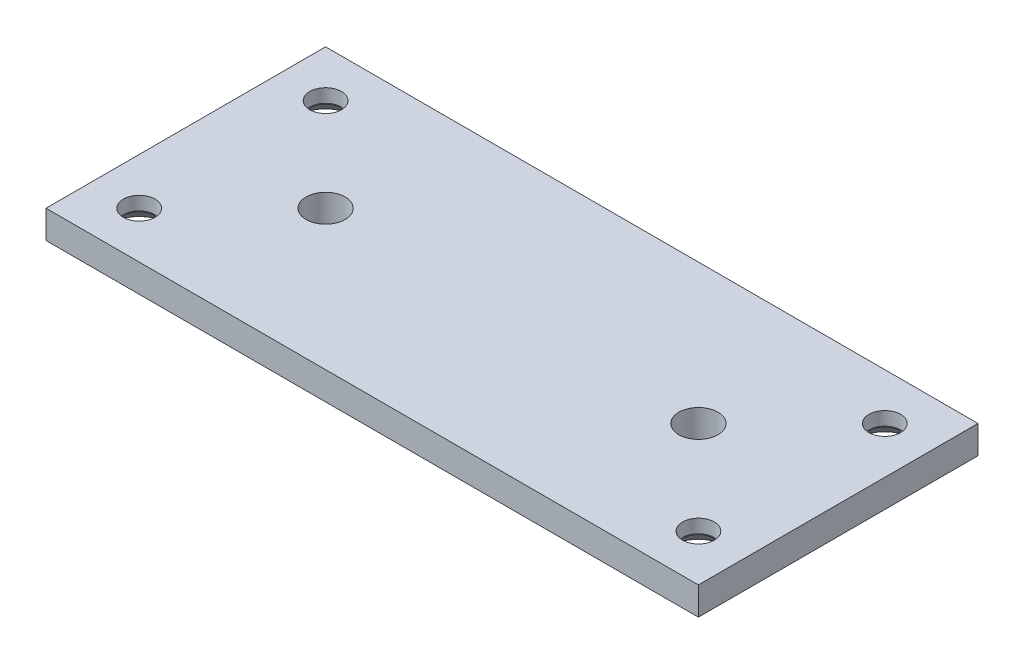
ISO-10303-21;
HEADER;
FILE_DESCRIPTION(('STEP AP214'),'2;1');
FILE_NAME('part.step','',(''),(''),'','','');
FILE_SCHEMA(('AUTOMOTIVE_DESIGN { 1 0 10303 214 1 1 1 1 }'));
ENDSEC;
DATA;
#1=APPLICATION_CONTEXT('core data for automotive mechanical design processes');
#2=APPLICATION_PROTOCOL_DEFINITION('international standard','automotive_design',2000,#1);
#3=PRODUCT_CONTEXT('',#1,'mechanical');
#4=PRODUCT('Part','Part','',(#3));
#5=PRODUCT_RELATED_PRODUCT_CATEGORY('part','',(#4));
#6=PRODUCT_DEFINITION_FORMATION('','',#4);
#7=PRODUCT_DEFINITION_CONTEXT('part definition',#1,'design');
#8=PRODUCT_DEFINITION('design','',#6,#7);
#9=PRODUCT_DEFINITION_SHAPE('','',#8);
#10=(LENGTH_UNIT() NAMED_UNIT(*) SI_UNIT(.MILLI.,.METRE.));
#11=(NAMED_UNIT(*) PLANE_ANGLE_UNIT() SI_UNIT($,.RADIAN.));
#12=(NAMED_UNIT(*) SI_UNIT($,.STERADIAN.) SOLID_ANGLE_UNIT());
#13=UNCERTAINTY_MEASURE_WITH_UNIT(LENGTH_MEASURE(1.E-05),#10,'distance_accuracy_value','');
#14=(GEOMETRIC_REPRESENTATION_CONTEXT(3) GLOBAL_UNCERTAINTY_ASSIGNED_CONTEXT((#13)) GLOBAL_UNIT_ASSIGNED_CONTEXT((#10,
#11,#12)) REPRESENTATION_CONTEXT('',''));
#15=CARTESIAN_POINT('',(0.,0.,0.));
#16=DIRECTION('',(0.,0.,1.));
#17=DIRECTION('',(1.,0.,0.));
#18=AXIS2_PLACEMENT_3D('',#15,#16,#17);
#19=CARTESIAN_POINT('',(0.,-1.5,0.));
#20=DIRECTION('',(0.,-1.,0.));
#21=DIRECTION('',(0.,0.,-1.));
#22=AXIS2_PLACEMENT_3D('',#19,#20,#21);
#23=PLANE('',#22);
#24=CARTESIAN_POINT('',(-30.,-1.5,-10.));
#25=DIRECTION('',(0.,1.,0.));
#26=DIRECTION('',(0.,0.,1.));
#27=AXIS2_PLACEMENT_3D('',#24,#25,#26);
#28=CIRCLE('',#27,3.15);
#29=CARTESIAN_POINT('',(-30.,-1.5,-6.85));
#30=VERTEX_POINT('',#29);
#31=EDGE_CURVE('E212',#30,#30,#28,.T.);
#32=ORIENTED_EDGE('',*,*,#31,.T.);
#33=EDGE_LOOP('',(#32));
#34=FACE_BOUND('',#33,.T.);
#35=CARTESIAN_POINT('',(20.,-1.5,0.));
#36=DIRECTION('',(0.,1.,0.));
#37=DIRECTION('',(0.,0.,-1.));
#38=AXIS2_PLACEMENT_3D('',#35,#36,#37);
#39=CIRCLE('',#38,2.1);
#40=CARTESIAN_POINT('',(20.,-1.5,-2.1));
#41=VERTEX_POINT('',#40);
#42=EDGE_CURVE('E146',#41,#41,#39,.T.);
#43=ORIENTED_EDGE('',*,*,#42,.T.);
#44=EDGE_LOOP('',(#43));
#45=FACE_BOUND('',#44,.T.);
#46=DIRECTION('',(0.,0.,-1.));
#47=VECTOR('',#46,1.);
#48=CARTESIAN_POINT('',(35.,-1.5,15.));
#49=LINE('',#48,#47);
#50=CARTESIAN_POINT('',(35.,-1.5,15.));
#51=VERTEX_POINT('',#50);
#52=CARTESIAN_POINT('',(35.,-1.5,-15.));
#53=VERTEX_POINT('',#52);
#54=EDGE_CURVE('E114',#51,#53,#49,.T.);
#55=ORIENTED_EDGE('',*,*,#54,.F.);
#56=DIRECTION('',(1.,0.,0.));
#57=VECTOR('',#56,1.);
#58=CARTESIAN_POINT('',(-35.,-1.5,15.));
#59=LINE('',#58,#57);
#60=CARTESIAN_POINT('',(-35.,-1.5,15.));
#61=VERTEX_POINT('',#60);
#62=EDGE_CURVE('E84',#61,#51,#59,.T.);
#63=ORIENTED_EDGE('',*,*,#62,.F.);
#64=DIRECTION('',(0.,0.,1.));
#65=VECTOR('',#64,1.);
#66=CARTESIAN_POINT('',(-35.,-1.5,15.));
#67=LINE('',#66,#65);
#68=CARTESIAN_POINT('',(-35.,-1.5,-15.));
#69=VERTEX_POINT('',#68);
#70=EDGE_CURVE('E78',#69,#61,#67,.T.);
#71=ORIENTED_EDGE('',*,*,#70,.F.);
#72=DIRECTION('',(-1.,0.,0.));
#73=VECTOR('',#72,1.);
#74=CARTESIAN_POINT('',(-35.,-1.5,-15.));
#75=LINE('',#74,#73);
#76=EDGE_CURVE('E102',#53,#69,#75,.T.);
#77=ORIENTED_EDGE('',*,*,#76,.F.);
#78=EDGE_LOOP('',(#55,#63,#71,#77));
#79=FACE_BOUND('',#78,.T.);
#80=CARTESIAN_POINT('',(-20.,-1.5,0.));
#81=DIRECTION('',(0.,1.,0.));
#82=DIRECTION('',(0.,0.,1.));
#83=AXIS2_PLACEMENT_3D('',#80,#81,#82);
#84=CIRCLE('',#83,2.1);
#85=CARTESIAN_POINT('',(-20.,-1.5,2.1));
#86=VERTEX_POINT('',#85);
#87=EDGE_CURVE('E138',#86,#86,#84,.T.);
#88=ORIENTED_EDGE('',*,*,#87,.T.);
#89=EDGE_LOOP('',(#88));
#90=FACE_BOUND('',#89,.T.);
#91=CARTESIAN_POINT('',(-30.,-1.5,10.));
#92=DIRECTION('',(0.,1.,0.));
#93=DIRECTION('',(0.,0.,1.));
#94=AXIS2_PLACEMENT_3D('',#91,#92,#93);
#95=CIRCLE('',#94,3.15);
#96=CARTESIAN_POINT('',(-30.,-1.5,13.15));
#97=VERTEX_POINT('',#96);
#98=EDGE_CURVE('E164',#97,#97,#95,.T.);
#99=ORIENTED_EDGE('',*,*,#98,.T.);
#100=EDGE_LOOP('',(#99));
#101=FACE_BOUND('',#100,.T.);
#102=CARTESIAN_POINT('',(30.,-1.5,10.));
#103=DIRECTION('',(0.,1.,0.));
#104=DIRECTION('',(0.,0.,1.));
#105=AXIS2_PLACEMENT_3D('',#102,#103,#104);
#106=CIRCLE('',#105,3.15);
#107=CARTESIAN_POINT('',(30.,-1.5,13.15));
#108=VERTEX_POINT('',#107);
#109=EDGE_CURVE('E180',#108,#108,#106,.T.);
#110=ORIENTED_EDGE('',*,*,#109,.T.);
#111=EDGE_LOOP('',(#110));
#112=FACE_BOUND('',#111,.T.);
#113=CARTESIAN_POINT('',(30.,-1.5,-10.));
#114=DIRECTION('',(0.,1.,0.));
#115=DIRECTION('',(0.,0.,1.));
#116=AXIS2_PLACEMENT_3D('',#113,#114,#115);
#117=CIRCLE('',#116,3.15);
#118=CARTESIAN_POINT('',(30.,-1.5,-6.85));
#119=VERTEX_POINT('',#118);
#120=EDGE_CURVE('E196',#119,#119,#117,.T.);
#121=ORIENTED_EDGE('',*,*,#120,.T.);
#122=EDGE_LOOP('',(#121));
#123=FACE_BOUND('',#122,.T.);
#124=ADVANCED_FACE('F43',(#34,#45,#79,#90,#101,#112,#123),#23,.T.);
#125=CARTESIAN_POINT('',(0.,1.5,0.));
#126=DIRECTION('',(0.,-1.,0.));
#127=DIRECTION('',(0.,0.,-1.));
#128=AXIS2_PLACEMENT_3D('',#125,#126,#127);
#129=PLANE('',#128);
#130=CARTESIAN_POINT('',(-30.,1.5,-10.));
#131=DIRECTION('',(0.,1.,0.));
#132=DIRECTION('',(0.,0.,1.));
#133=AXIS2_PLACEMENT_3D('',#130,#131,#132);
#134=CIRCLE('',#133,1.7);
#135=CARTESIAN_POINT('',(-30.,1.5,-8.3));
#136=VERTEX_POINT('',#135);
#137=EDGE_CURVE('E200',#136,#136,#134,.T.);
#138=ORIENTED_EDGE('',*,*,#137,.F.);
#139=EDGE_LOOP('',(#138));
#140=FACE_BOUND('',#139,.T.);
#141=CARTESIAN_POINT('',(30.,1.5,-10.));
#142=DIRECTION('',(0.,1.,0.));
#143=DIRECTION('',(0.,0.,1.));
#144=AXIS2_PLACEMENT_3D('',#141,#142,#143);
#145=CIRCLE('',#144,1.7);
#146=CARTESIAN_POINT('',(30.,1.5,-8.3));
#147=VERTEX_POINT('',#146);
#148=EDGE_CURVE('E184',#147,#147,#145,.T.);
#149=ORIENTED_EDGE('',*,*,#148,.F.);
#150=EDGE_LOOP('',(#149));
#151=FACE_BOUND('',#150,.T.);
#152=CARTESIAN_POINT('',(30.,1.5,10.));
#153=DIRECTION('',(0.,1.,0.));
#154=DIRECTION('',(0.,0.,1.));
#155=AXIS2_PLACEMENT_3D('',#152,#153,#154);
#156=CIRCLE('',#155,1.7);
#157=CARTESIAN_POINT('',(30.,1.5,11.7));
#158=VERTEX_POINT('',#157);
#159=EDGE_CURVE('E168',#158,#158,#156,.T.);
#160=ORIENTED_EDGE('',*,*,#159,.F.);
#161=EDGE_LOOP('',(#160));
#162=FACE_BOUND('',#161,.T.);
#163=CARTESIAN_POINT('',(-30.,1.5,10.));
#164=DIRECTION('',(0.,1.,0.));
#165=DIRECTION('',(0.,0.,1.));
#166=AXIS2_PLACEMENT_3D('',#163,#164,#165);
#167=CIRCLE('',#166,1.7);
#168=CARTESIAN_POINT('',(-30.,1.5,11.7));
#169=VERTEX_POINT('',#168);
#170=EDGE_CURVE('E150',#169,#169,#167,.T.);
#171=ORIENTED_EDGE('',*,*,#170,.F.);
#172=EDGE_LOOP('',(#171));
#173=FACE_BOUND('',#172,.T.);
#174=DIRECTION('',(0.,0.,-1.));
#175=VECTOR('',#174,1.);
#176=CARTESIAN_POINT('',(35.,1.5,15.));
#177=LINE('',#176,#175);
#178=CARTESIAN_POINT('',(35.,1.5,15.));
#179=VERTEX_POINT('',#178);
#180=CARTESIAN_POINT('',(35.,1.5,-15.));
#181=VERTEX_POINT('',#180);
#182=EDGE_CURVE('E97',#179,#181,#177,.T.);
#183=ORIENTED_EDGE('',*,*,#182,.T.);
#184=DIRECTION('',(-1.,0.,0.));
#185=VECTOR('',#184,1.);
#186=CARTESIAN_POINT('',(-35.,1.5,-15.));
#187=LINE('',#186,#185);
#188=CARTESIAN_POINT('',(-35.,1.5,-15.));
#189=VERTEX_POINT('',#188);
#190=EDGE_CURVE('E91',#181,#189,#187,.T.);
#191=ORIENTED_EDGE('',*,*,#190,.T.);
#192=DIRECTION('',(0.,0.,1.));
#193=VECTOR('',#192,1.);
#194=CARTESIAN_POINT('',(-35.,1.5,15.));
#195=LINE('',#194,#193);
#196=CARTESIAN_POINT('',(-35.,1.5,15.));
#197=VERTEX_POINT('',#196);
#198=EDGE_CURVE('E95',#189,#197,#195,.T.);
#199=ORIENTED_EDGE('',*,*,#198,.T.);
#200=DIRECTION('',(1.,0.,0.));
#201=VECTOR('',#200,1.);
#202=CARTESIAN_POINT('',(-35.,1.5,15.));
#203=LINE('',#202,#201);
#204=EDGE_CURVE('E61',#197,#179,#203,.T.);
#205=ORIENTED_EDGE('',*,*,#204,.T.);
#206=EDGE_LOOP('',(#183,#191,#199,#205));
#207=FACE_BOUND('',#206,.T.);
#208=CARTESIAN_POINT('',(-20.,1.5,0.));
#209=DIRECTION('',(0.,1.,0.));
#210=DIRECTION('',(0.,0.,1.));
#211=AXIS2_PLACEMENT_3D('',#208,#209,#210);
#212=CIRCLE('',#211,2.1);
#213=CARTESIAN_POINT('',(-20.,1.5,2.1));
#214=VERTEX_POINT('',#213);
#215=EDGE_CURVE('E118',#214,#214,#212,.T.);
#216=ORIENTED_EDGE('',*,*,#215,.F.);
#217=EDGE_LOOP('',(#216));
#218=FACE_BOUND('',#217,.T.);
#219=CARTESIAN_POINT('',(20.,1.5,0.));
#220=DIRECTION('',(0.,1.,0.));
#221=DIRECTION('',(0.,0.,-1.));
#222=AXIS2_PLACEMENT_3D('',#219,#220,#221);
#223=CIRCLE('',#222,2.1);
#224=CARTESIAN_POINT('',(20.,1.5,-2.1));
#225=VERTEX_POINT('',#224);
#226=EDGE_CURVE('E142',#225,#225,#223,.T.);
#227=ORIENTED_EDGE('',*,*,#226,.F.);
#228=EDGE_LOOP('',(#227));
#229=FACE_BOUND('',#228,.T.);
#230=ADVANCED_FACE('F92',(#140,#151,#162,#173,#207,#218,#229),#129,.F.);
#231=CARTESIAN_POINT('',(35.,1.5,15.));
#232=DIRECTION('',(-1.,0.,0.));
#233=DIRECTION('',(0.,0.,1.));
#234=AXIS2_PLACEMENT_3D('',#231,#232,#233);
#235=PLANE('',#234);
#236=ORIENTED_EDGE('',*,*,#54,.T.);
#237=DIRECTION('',(0.,-1.,0.));
#238=VECTOR('',#237,1.);
#239=CARTESIAN_POINT('',(35.,1.5,-15.));
#240=LINE('',#239,#238);
#241=EDGE_CURVE('E11',#181,#53,#240,.T.);
#242=ORIENTED_EDGE('',*,*,#241,.F.);
#243=ORIENTED_EDGE('',*,*,#182,.F.);
#244=DIRECTION('',(0.,-1.,0.));
#245=VECTOR('',#244,1.);
#246=CARTESIAN_POINT('',(35.,1.5,15.));
#247=LINE('',#246,#245);
#248=EDGE_CURVE('E110',#179,#51,#247,.T.);
#249=ORIENTED_EDGE('',*,*,#248,.T.);
#250=EDGE_LOOP('',(#236,#242,#243,#249));
#251=FACE_BOUND('',#250,.T.);
#252=ADVANCED_FACE('F45',(#251),#235,.F.);
#253=CARTESIAN_POINT('',(-35.,1.5,-15.));
#254=DIRECTION('',(0.,0.,1.));
#255=DIRECTION('',(1.,0.,0.));
#256=AXIS2_PLACEMENT_3D('',#253,#254,#255);
#257=PLANE('',#256);
#258=ORIENTED_EDGE('',*,*,#76,.T.);
#259=DIRECTION('',(0.,-1.,0.));
#260=VECTOR('',#259,1.);
#261=CARTESIAN_POINT('',(-35.,1.5,-15.));
#262=LINE('',#261,#260);
#263=EDGE_CURVE('E53',#189,#69,#262,.T.);
#264=ORIENTED_EDGE('',*,*,#263,.F.);
#265=ORIENTED_EDGE('',*,*,#190,.F.);
#266=ORIENTED_EDGE('',*,*,#241,.T.);
#267=EDGE_LOOP('',(#258,#264,#265,#266));
#268=FACE_BOUND('',#267,.T.);
#269=ADVANCED_FACE('F101',(#268),#257,.F.);
#270=CARTESIAN_POINT('',(-35.,1.5,15.));
#271=DIRECTION('',(1.,0.,0.));
#272=DIRECTION('',(0.,0.,-1.));
#273=AXIS2_PLACEMENT_3D('',#270,#271,#272);
#274=PLANE('',#273);
#275=ORIENTED_EDGE('',*,*,#70,.T.);
#276=DIRECTION('',(0.,-1.,0.));
#277=VECTOR('',#276,1.);
#278=CARTESIAN_POINT('',(-35.,1.5,15.));
#279=LINE('',#278,#277);
#280=EDGE_CURVE('E104',#197,#61,#279,.T.);
#281=ORIENTED_EDGE('',*,*,#280,.F.);
#282=ORIENTED_EDGE('',*,*,#198,.F.);
#283=ORIENTED_EDGE('',*,*,#263,.T.);
#284=EDGE_LOOP('',(#275,#281,#282,#283));
#285=FACE_BOUND('',#284,.T.);
#286=ADVANCED_FACE('F105',(#285),#274,.F.);
#287=CARTESIAN_POINT('',(-35.,1.5,15.));
#288=DIRECTION('',(0.,0.,-1.));
#289=DIRECTION('',(-1.,0.,0.));
#290=AXIS2_PLACEMENT_3D('',#287,#288,#289);
#291=PLANE('',#290);
#292=ORIENTED_EDGE('',*,*,#62,.T.);
#293=ORIENTED_EDGE('',*,*,#248,.F.);
#294=ORIENTED_EDGE('',*,*,#204,.F.);
#295=ORIENTED_EDGE('',*,*,#280,.T.);
#296=EDGE_LOOP('',(#292,#293,#294,#295));
#297=FACE_BOUND('',#296,.T.);
#298=ADVANCED_FACE('F130',(#297),#291,.F.);
#299=CARTESIAN_POINT('',(-20.,1.5,0.));
#300=DIRECTION('',(0.,-1.,0.));
#301=DIRECTION('',(0.,0.,-1.));
#302=AXIS2_PLACEMENT_3D('',#299,#300,#301);
#303=CYLINDRICAL_SURFACE('',#302,2.1);
#304=ORIENTED_EDGE('',*,*,#215,.T.);
#305=EDGE_LOOP('',(#304));
#306=FACE_BOUND('',#305,.T.);
#307=ORIENTED_EDGE('',*,*,#87,.F.);
#308=EDGE_LOOP('',(#307));
#309=FACE_BOUND('',#308,.T.);
#310=ADVANCED_FACE('F261',(#306,#309),#303,.F.);
#311=CARTESIAN_POINT('',(20.,1.5,0.));
#312=DIRECTION('',(0.,-1.,0.));
#313=DIRECTION('',(0.,0.,-1.));
#314=AXIS2_PLACEMENT_3D('',#311,#312,#313);
#315=CYLINDRICAL_SURFACE('',#314,2.1);
#316=ORIENTED_EDGE('',*,*,#226,.T.);
#317=EDGE_LOOP('',(#316));
#318=FACE_BOUND('',#317,.T.);
#319=ORIENTED_EDGE('',*,*,#42,.F.);
#320=EDGE_LOOP('',(#319));
#321=FACE_BOUND('',#320,.T.);
#322=ADVANCED_FACE('F251',(#318,#321),#315,.F.);
#323=CARTESIAN_POINT('',(-30.,1.5,10.));
#324=DIRECTION('',(0.,1.,0.));
#325=DIRECTION('',(0.,0.,1.));
#326=AXIS2_PLACEMENT_3D('',#323,#324,#325);
#327=CYLINDRICAL_SURFACE('',#326,1.7);
#328=CARTESIAN_POINT('',(-30.,0.0500000000000006,10.));
#329=DIRECTION('',(0.,1.,0.));
#330=DIRECTION('',(0.,0.,1.));
#331=AXIS2_PLACEMENT_3D('',#328,#329,#330);
#332=CIRCLE('',#331,1.7);
#333=CARTESIAN_POINT('',(-30.,0.0500000000000006,11.7));
#334=VERTEX_POINT('',#333);
#335=EDGE_CURVE('E157',#334,#334,#332,.T.);
#336=ORIENTED_EDGE('',*,*,#335,.F.);
#337=EDGE_LOOP('',(#336));
#338=FACE_BOUND('',#337,.T.);
#339=ORIENTED_EDGE('',*,*,#170,.T.);
#340=EDGE_LOOP('',(#339));
#341=FACE_BOUND('',#340,.T.);
#342=ADVANCED_FACE('F248',(#338,#341),#327,.F.);
#343=CARTESIAN_POINT('',(-28.3,0.0500000000000006,10.));
#344=DIRECTION('',(0.,-1.,0.));
#345=DIRECTION('',(0.,0.,-1.));
#346=AXIS2_PLACEMENT_3D('',#343,#344,#345);
#347=PLANE('',#346);
#348=CARTESIAN_POINT('',(-30.,0.0500000000000006,10.));
#349=DIRECTION('',(0.,1.,0.));
#350=DIRECTION('',(0.,0.,1.));
#351=AXIS2_PLACEMENT_3D('',#348,#349,#350);
#352=CIRCLE('',#351,1.6);
#353=CARTESIAN_POINT('',(-30.,0.0500000000000006,11.6));
#354=VERTEX_POINT('',#353);
#355=EDGE_CURVE('E160',#354,#354,#352,.T.);
#356=ORIENTED_EDGE('',*,*,#355,.F.);
#357=EDGE_LOOP('',(#356));
#358=FACE_BOUND('',#357,.T.);
#359=ORIENTED_EDGE('',*,*,#335,.T.);
#360=EDGE_LOOP('',(#359));
#361=FACE_BOUND('',#360,.T.);
#362=ADVANCED_FACE('F250',(#358,#361),#347,.F.);
#363=CARTESIAN_POINT('',(-30.,0.0500000000000006,10.));
#364=DIRECTION('',(0.,-1.,0.));
#365=DIRECTION('',(0.,0.,-1.));
#366=AXIS2_PLACEMENT_3D('',#363,#364,#365);
#367=CONICAL_SURFACE('',#366,1.6,0.785398163397448);
#368=ORIENTED_EDGE('',*,*,#98,.F.);
#369=EDGE_LOOP('',(#368));
#370=FACE_BOUND('',#369,.T.);
#371=ORIENTED_EDGE('',*,*,#355,.T.);
#372=EDGE_LOOP('',(#371));
#373=FACE_BOUND('',#372,.T.);
#374=ADVANCED_FACE('F258',(#370,#373),#367,.F.);
#375=CARTESIAN_POINT('',(30.,1.5,10.));
#376=DIRECTION('',(0.,1.,0.));
#377=DIRECTION('',(0.,0.,1.));
#378=AXIS2_PLACEMENT_3D('',#375,#376,#377);
#379=CYLINDRICAL_SURFACE('',#378,1.7);
#380=CARTESIAN_POINT('',(30.,0.0500000000000006,10.));
#381=DIRECTION('',(0.,1.,0.));
#382=DIRECTION('',(0.,0.,1.));
#383=AXIS2_PLACEMENT_3D('',#380,#381,#382);
#384=CIRCLE('',#383,1.7);
#385=CARTESIAN_POINT('',(30.,0.0500000000000006,11.7));
#386=VERTEX_POINT('',#385);
#387=EDGE_CURVE('E172',#386,#386,#384,.T.);
#388=ORIENTED_EDGE('',*,*,#387,.F.);
#389=EDGE_LOOP('',(#388));
#390=FACE_BOUND('',#389,.T.);
#391=ORIENTED_EDGE('',*,*,#159,.T.);
#392=EDGE_LOOP('',(#391));
#393=FACE_BOUND('',#392,.T.);
#394=ADVANCED_FACE('F310',(#390,#393),#379,.F.);
#395=CARTESIAN_POINT('',(31.7,0.0500000000000006,10.));
#396=DIRECTION('',(0.,-1.,0.));
#397=DIRECTION('',(0.,0.,-1.));
#398=AXIS2_PLACEMENT_3D('',#395,#396,#397);
#399=PLANE('',#398);
#400=CARTESIAN_POINT('',(30.,0.0500000000000006,10.));
#401=DIRECTION('',(0.,1.,0.));
#402=DIRECTION('',(0.,0.,1.));
#403=AXIS2_PLACEMENT_3D('',#400,#401,#402);
#404=CIRCLE('',#403,1.6);
#405=CARTESIAN_POINT('',(30.,0.0500000000000006,11.6));
#406=VERTEX_POINT('',#405);
#407=EDGE_CURVE('E176',#406,#406,#404,.T.);
#408=ORIENTED_EDGE('',*,*,#407,.F.);
#409=EDGE_LOOP('',(#408));
#410=FACE_BOUND('',#409,.T.);
#411=ORIENTED_EDGE('',*,*,#387,.T.);
#412=EDGE_LOOP('',(#411));
#413=FACE_BOUND('',#412,.T.);
#414=ADVANCED_FACE('F321',(#410,#413),#399,.F.);
#415=CARTESIAN_POINT('',(30.,0.0500000000000006,10.));
#416=DIRECTION('',(0.,-1.,0.));
#417=DIRECTION('',(0.,0.,-1.));
#418=AXIS2_PLACEMENT_3D('',#415,#416,#417);
#419=CONICAL_SURFACE('',#418,1.6,0.785398163397449);
#420=ORIENTED_EDGE('',*,*,#109,.F.);
#421=EDGE_LOOP('',(#420));
#422=FACE_BOUND('',#421,.T.);
#423=ORIENTED_EDGE('',*,*,#407,.T.);
#424=EDGE_LOOP('',(#423));
#425=FACE_BOUND('',#424,.T.);
#426=ADVANCED_FACE('F332',(#422,#425),#419,.F.);
#427=CARTESIAN_POINT('',(30.,1.5,-10.));
#428=DIRECTION('',(0.,1.,0.));
#429=DIRECTION('',(0.,0.,1.));
#430=AXIS2_PLACEMENT_3D('',#427,#428,#429);
#431=CYLINDRICAL_SURFACE('',#430,1.7);
#432=CARTESIAN_POINT('',(30.,0.0500000000000006,-10.));
#433=DIRECTION('',(0.,1.,0.));
#434=DIRECTION('',(0.,0.,1.));
#435=AXIS2_PLACEMENT_3D('',#432,#433,#434);
#436=CIRCLE('',#435,1.7);
#437=CARTESIAN_POINT('',(30.,0.0500000000000006,-8.3));
#438=VERTEX_POINT('',#437);
#439=EDGE_CURVE('E188',#438,#438,#436,.T.);
#440=ORIENTED_EDGE('',*,*,#439,.F.);
#441=EDGE_LOOP('',(#440));
#442=FACE_BOUND('',#441,.T.);
#443=ORIENTED_EDGE('',*,*,#148,.T.);
#444=EDGE_LOOP('',(#443));
#445=FACE_BOUND('',#444,.T.);
#446=ADVANCED_FACE('F343',(#442,#445),#431,.F.);
#447=CARTESIAN_POINT('',(31.7,0.0500000000000006,-10.));
#448=DIRECTION('',(0.,-1.,0.));
#449=DIRECTION('',(0.,0.,-1.));
#450=AXIS2_PLACEMENT_3D('',#447,#448,#449);
#451=PLANE('',#450);
#452=CARTESIAN_POINT('',(30.,0.0500000000000006,-10.));
#453=DIRECTION('',(0.,1.,0.));
#454=DIRECTION('',(0.,0.,1.));
#455=AXIS2_PLACEMENT_3D('',#452,#453,#454);
#456=CIRCLE('',#455,1.6);
#457=CARTESIAN_POINT('',(30.,0.0500000000000006,-8.4));
#458=VERTEX_POINT('',#457);
#459=EDGE_CURVE('E192',#458,#458,#456,.T.);
#460=ORIENTED_EDGE('',*,*,#459,.F.);
#461=EDGE_LOOP('',(#460));
#462=FACE_BOUND('',#461,.T.);
#463=ORIENTED_EDGE('',*,*,#439,.T.);
#464=EDGE_LOOP('',(#463));
#465=FACE_BOUND('',#464,.T.);
#466=ADVANCED_FACE('F354',(#462,#465),#451,.F.);
#467=CARTESIAN_POINT('',(30.,0.0500000000000006,-10.));
#468=DIRECTION('',(0.,-1.,0.));
#469=DIRECTION('',(0.,0.,-1.));
#470=AXIS2_PLACEMENT_3D('',#467,#468,#469);
#471=CONICAL_SURFACE('',#470,1.6,0.785398163397449);
#472=ORIENTED_EDGE('',*,*,#120,.F.);
#473=EDGE_LOOP('',(#472));
#474=FACE_BOUND('',#473,.T.);
#475=ORIENTED_EDGE('',*,*,#459,.T.);
#476=EDGE_LOOP('',(#475));
#477=FACE_BOUND('',#476,.T.);
#478=ADVANCED_FACE('F235',(#474,#477),#471,.F.);
#479=CARTESIAN_POINT('',(-30.,1.5,-10.));
#480=DIRECTION('',(0.,1.,0.));
#481=DIRECTION('',(0.,0.,1.));
#482=AXIS2_PLACEMENT_3D('',#479,#480,#481);
#483=CYLINDRICAL_SURFACE('',#482,1.7);
#484=CARTESIAN_POINT('',(-30.,0.0500000000000006,-10.));
#485=DIRECTION('',(0.,1.,0.));
#486=DIRECTION('',(0.,0.,1.));
#487=AXIS2_PLACEMENT_3D('',#484,#485,#486);
#488=CIRCLE('',#487,1.7);
#489=CARTESIAN_POINT('',(-30.,0.0500000000000006,-8.3));
#490=VERTEX_POINT('',#489);
#491=EDGE_CURVE('E204',#490,#490,#488,.T.);
#492=ORIENTED_EDGE('',*,*,#491,.F.);
#493=EDGE_LOOP('',(#492));
#494=FACE_BOUND('',#493,.T.);
#495=ORIENTED_EDGE('',*,*,#137,.T.);
#496=EDGE_LOOP('',(#495));
#497=FACE_BOUND('',#496,.T.);
#498=ADVANCED_FACE('F229',(#494,#497),#483,.F.);
#499=CARTESIAN_POINT('',(-28.3,0.0500000000000006,-10.));
#500=DIRECTION('',(0.,-1.,0.));
#501=DIRECTION('',(0.,0.,-1.));
#502=AXIS2_PLACEMENT_3D('',#499,#500,#501);
#503=PLANE('',#502);
#504=CARTESIAN_POINT('',(-30.,0.0500000000000006,-10.));
#505=DIRECTION('',(0.,1.,0.));
#506=DIRECTION('',(0.,0.,1.));
#507=AXIS2_PLACEMENT_3D('',#504,#505,#506);
#508=CIRCLE('',#507,1.6);
#509=CARTESIAN_POINT('',(-30.,0.0500000000000006,-8.4));
#510=VERTEX_POINT('',#509);
#511=EDGE_CURVE('E208',#510,#510,#508,.T.);
#512=ORIENTED_EDGE('',*,*,#511,.F.);
#513=EDGE_LOOP('',(#512));
#514=FACE_BOUND('',#513,.T.);
#515=ORIENTED_EDGE('',*,*,#491,.T.);
#516=EDGE_LOOP('',(#515));
#517=FACE_BOUND('',#516,.T.);
#518=ADVANCED_FACE('F223',(#514,#517),#503,.F.);
#519=CARTESIAN_POINT('',(-30.,0.0500000000000006,-10.));
#520=DIRECTION('',(0.,-1.,0.));
#521=DIRECTION('',(0.,0.,-1.));
#522=AXIS2_PLACEMENT_3D('',#519,#520,#521);
#523=CONICAL_SURFACE('',#522,1.6,0.785398163397448);
#524=ORIENTED_EDGE('',*,*,#31,.F.);
#525=EDGE_LOOP('',(#524));
#526=FACE_BOUND('',#525,.T.);
#527=ORIENTED_EDGE('',*,*,#511,.T.);
#528=EDGE_LOOP('',(#527));
#529=FACE_BOUND('',#528,.T.);
#530=ADVANCED_FACE('F220',(#526,#529),#523,.F.);
#531=CLOSED_SHELL('',(#124,#230,#252,#269,#286,#298,#310,#322,#342,#362,#374,#394,#414,#426,
#446,#466,#478,#498,#518,#530));
#532=MANIFOLD_SOLID_BREP('B2',#531);
#533=ADVANCED_BREP_SHAPE_REPRESENTATION('',(#18,#532),#14);
#534=SHAPE_DEFINITION_REPRESENTATION(#9,#533);
ENDSEC;
END-ISO-10303-21;
